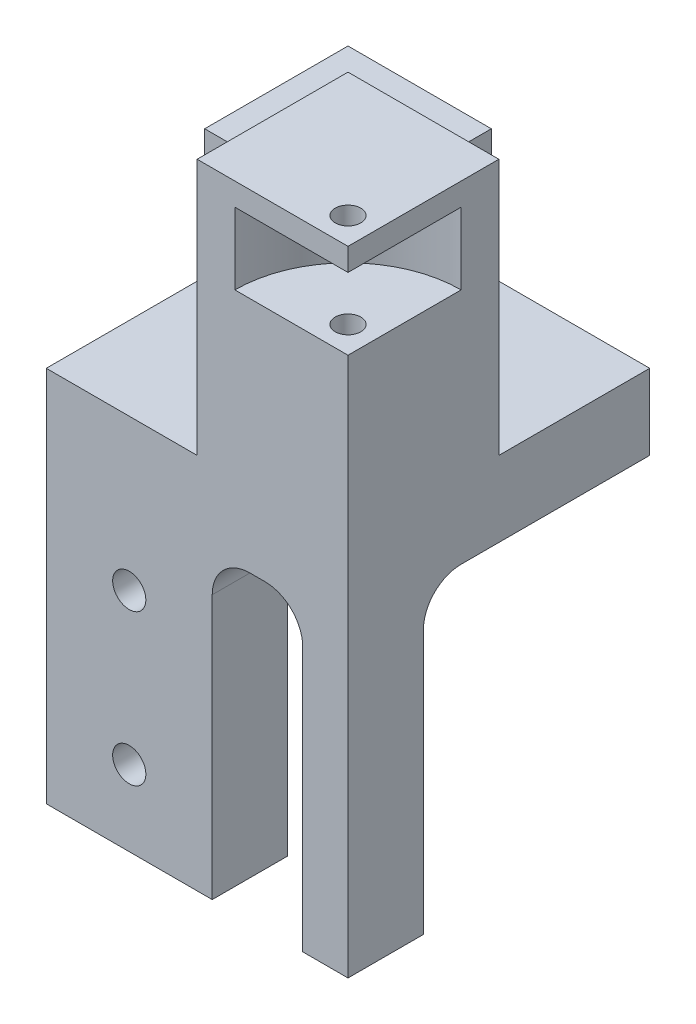
ISO-10303-21;
HEADER;
FILE_DESCRIPTION(('STEP AP214'),'2;1');
FILE_NAME('part.step','',(''),(''),'','','');
FILE_SCHEMA(('AUTOMOTIVE_DESIGN { 1 0 10303 214 1 1 1 1 }'));
ENDSEC;
DATA;
#1=APPLICATION_CONTEXT('core data for automotive mechanical design processes');
#2=APPLICATION_PROTOCOL_DEFINITION('international standard','automotive_design',2000,#1);
#3=PRODUCT_CONTEXT('',#1,'mechanical');
#4=PRODUCT('Part','Part','',(#3));
#5=PRODUCT_RELATED_PRODUCT_CATEGORY('part','',(#4));
#6=PRODUCT_DEFINITION_FORMATION('','',#4);
#7=PRODUCT_DEFINITION_CONTEXT('part definition',#1,'design');
#8=PRODUCT_DEFINITION('design','',#6,#7);
#9=PRODUCT_DEFINITION_SHAPE('','',#8);
#10=(LENGTH_UNIT() NAMED_UNIT(*) SI_UNIT(.MILLI.,.METRE.));
#11=(NAMED_UNIT(*) PLANE_ANGLE_UNIT() SI_UNIT($,.RADIAN.));
#12=(NAMED_UNIT(*) SI_UNIT($,.STERADIAN.) SOLID_ANGLE_UNIT());
#13=UNCERTAINTY_MEASURE_WITH_UNIT(LENGTH_MEASURE(1.E-05),#10,'distance_accuracy_value','');
#14=(GEOMETRIC_REPRESENTATION_CONTEXT(3) GLOBAL_UNCERTAINTY_ASSIGNED_CONTEXT((#13)) GLOBAL_UNIT_ASSIGNED_CONTEXT((#10,
#11,#12)) REPRESENTATION_CONTEXT('',''));
#15=CARTESIAN_POINT('',(0.,0.,0.));
#16=DIRECTION('',(0.,0.,1.));
#17=DIRECTION('',(1.,0.,0.));
#18=AXIS2_PLACEMENT_3D('',#15,#16,#17);
#19=CARTESIAN_POINT('',(-6.36538506760728,-50.,10.));
#20=DIRECTION('',(0.,1.,0.));
#21=DIRECTION('',(-1.,0.,0.));
#22=AXIS2_PLACEMENT_3D('',#19,#20,#21);
#23=PLANE('',#22);
#24=CARTESIAN_POINT('',(30.0990810264598,-50.,6.46446609406742));
#25=DIRECTION('',(0.,-1.,0.));
#26=DIRECTION('',(1.,0.,0.));
#27=AXIS2_PLACEMENT_3D('',#24,#25,#26);
#28=CIRCLE('',#27,1.69999999999999);
#29=CARTESIAN_POINT('',(31.7990810264598,-50.,6.46446609406742));
#30=VERTEX_POINT('',#29);
#31=EDGE_CURVE('E326',#30,#30,#28,.T.);
#32=ORIENTED_EDGE('',*,*,#31,.F.);
#33=EDGE_LOOP('',(#32));
#34=FACE_BOUND('',#33,.T.);
#35=DIRECTION('',(1.,0.,0.));
#36=VECTOR('',#35,1.);
#37=CARTESIAN_POINT('',(-6.36538506760728,-50.,10.));
#38=LINE('',#37,#36);
#39=CARTESIAN_POINT('',(27.6346149323927,-50.,10.));
#40=VERTEX_POINT('',#39);
#41=CARTESIAN_POINT('',(33.6346149323927,-50.,10.));
#42=VERTEX_POINT('',#41);
#43=EDGE_CURVE('E241',#40,#42,#38,.T.);
#44=ORIENTED_EDGE('',*,*,#43,.F.);
#45=DIRECTION('',(0.,0.,1.));
#46=VECTOR('',#45,1.);
#47=CARTESIAN_POINT('',(27.6346149323927,-50.,-30.001));
#48=LINE('',#47,#46);
#49=CARTESIAN_POINT('',(27.6346149323927,-50.,0.));
#50=VERTEX_POINT('',#49);
#51=EDGE_CURVE('E233',#50,#40,#48,.T.);
#52=ORIENTED_EDGE('',*,*,#51,.F.);
#53=DIRECTION('',(1.,0.,0.));
#54=VECTOR('',#53,1.);
#55=CARTESIAN_POINT('',(-6.36538506760728,-50.,0.));
#56=LINE('',#55,#54);
#57=CARTESIAN_POINT('',(33.6346149323927,-50.,0.));
#58=VERTEX_POINT('',#57);
#59=EDGE_CURVE('E254',#50,#58,#56,.T.);
#60=ORIENTED_EDGE('',*,*,#59,.T.);
#61=DIRECTION('',(0.,0.,-1.));
#62=VECTOR('',#61,1.);
#63=CARTESIAN_POINT('',(33.6346149323927,-50.,10.));
#64=LINE('',#63,#62);
#65=EDGE_CURVE('E263',#42,#58,#64,.T.);
#66=ORIENTED_EDGE('',*,*,#65,.F.);
#67=EDGE_LOOP('',(#44,#52,#60,#66));
#68=FACE_BOUND('',#67,.T.);
#69=ADVANCED_FACE('F43',(#34,#68),#23,.F.);
#70=CARTESIAN_POINT('',(0.,0.,0.));
#71=DIRECTION('',(0.,0.,1.));
#72=DIRECTION('',(1.,0.,0.));
#73=AXIS2_PLACEMENT_3D('',#70,#71,#72);
#74=PLANE('',#73);
#75=DIRECTION('',(0.,-1.,0.));
#76=VECTOR('',#75,1.);
#77=CARTESIAN_POINT('',(27.6346149323927,-50.,0.));
#78=LINE('',#77,#76);
#79=CARTESIAN_POINT('',(27.6346149323927,-15.,0.));
#80=VERTEX_POINT('',#79);
#81=EDGE_CURVE('E298',#80,#50,#78,.T.);
#82=ORIENTED_EDGE('',*,*,#81,.F.);
#83=DIRECTION('',(1.,0.,0.));
#84=VECTOR('',#83,1.);
#85=CARTESIAN_POINT('',(0.,-15.,0.));
#86=LINE('',#85,#84);
#87=CARTESIAN_POINT('',(33.6346149323927,-15.,0.));
#88=VERTEX_POINT('',#87);
#89=EDGE_CURVE('E60',#80,#88,#86,.T.);
#90=ORIENTED_EDGE('',*,*,#89,.T.);
#91=DIRECTION('',(0.,1.,0.));
#92=VECTOR('',#91,1.);
#93=CARTESIAN_POINT('',(33.6346149323927,0.,0.));
#94=LINE('',#93,#92);
#95=EDGE_CURVE('E257',#58,#88,#94,.T.);
#96=ORIENTED_EDGE('',*,*,#95,.F.);
#97=ORIENTED_EDGE('',*,*,#59,.F.);
#98=EDGE_LOOP('',(#82,#90,#96,#97));
#99=FACE_BOUND('',#98,.T.);
#100=ADVANCED_FACE('F485',(#99),#74,.F.);
#101=CARTESIAN_POINT('',(-6.36538506760727,0.,10.));
#102=DIRECTION('',(0.,-1.,0.));
#103=DIRECTION('',(1.,0.,0.));
#104=AXIS2_PLACEMENT_3D('',#101,#102,#103);
#105=PLANE('',#104);
#106=DIRECTION('',(1.,0.,0.));
#107=VECTOR('',#106,1.);
#108=CARTESIAN_POINT('',(-6.36538506760727,0.,-11.));
#109=LINE('',#108,#107);
#110=CARTESIAN_POINT('',(-6.36538506760727,0.,-11.));
#111=VERTEX_POINT('',#110);
#112=CARTESIAN_POINT('',(12.6346149323927,0.,-11.));
#113=VERTEX_POINT('',#112);
#114=EDGE_CURVE('E376',#111,#113,#109,.T.);
#115=ORIENTED_EDGE('',*,*,#114,.F.);
#116=DIRECTION('',(0.,0.,-1.));
#117=VECTOR('',#116,1.);
#118=CARTESIAN_POINT('',(-6.36538506760727,0.,10.));
#119=LINE('',#118,#117);
#120=CARTESIAN_POINT('',(-6.36538506760727,0.,10.));
#121=VERTEX_POINT('',#120);
#122=EDGE_CURVE('E251',#121,#111,#119,.T.);
#123=ORIENTED_EDGE('',*,*,#122,.F.);
#124=DIRECTION('',(-1.,0.,0.));
#125=VECTOR('',#124,1.);
#126=CARTESIAN_POINT('',(-6.36538506760727,0.,10.));
#127=LINE('',#126,#125);
#128=CARTESIAN_POINT('',(13.6346149323927,0.,10.));
#129=VERTEX_POINT('',#128);
#130=EDGE_CURVE('E249',#129,#121,#127,.T.);
#131=ORIENTED_EDGE('',*,*,#130,.F.);
#132=DIRECTION('',(0.,0.,1.));
#133=VECTOR('',#132,1.);
#134=CARTESIAN_POINT('',(13.6346149323927,0.,10.));
#135=LINE('',#134,#133);
#136=CARTESIAN_POINT('',(13.6346149323927,0.,-10.));
#137=VERTEX_POINT('',#136);
#138=EDGE_CURVE('E409',#137,#129,#135,.T.);
#139=ORIENTED_EDGE('',*,*,#138,.F.);
#140=DIRECTION('',(-1.,0.,0.));
#141=VECTOR('',#140,1.);
#142=CARTESIAN_POINT('',(33.6346149323927,0.,-10.));
#143=LINE('',#142,#141);
#144=CARTESIAN_POINT('',(33.6346149323927,0.,-10.));
#145=VERTEX_POINT('',#144);
#146=EDGE_CURVE('E404',#145,#137,#143,.T.);
#147=ORIENTED_EDGE('',*,*,#146,.F.);
#148=DIRECTION('',(0.,0.,-1.));
#149=VECTOR('',#148,1.);
#150=CARTESIAN_POINT('',(33.6346149323927,0.,10.));
#151=LINE('',#150,#149);
#152=CARTESIAN_POINT('',(33.6346149323927,0.,-30.));
#153=VERTEX_POINT('',#152);
#154=EDGE_CURVE('E261',#145,#153,#151,.T.);
#155=ORIENTED_EDGE('',*,*,#154,.T.);
#156=DIRECTION('',(-1.,0.,0.));
#157=VECTOR('',#156,1.);
#158=CARTESIAN_POINT('',(33.6346149323927,0.,-30.));
#159=LINE('',#158,#157);
#160=CARTESIAN_POINT('',(12.6346149323927,0.,-30.));
#161=VERTEX_POINT('',#160);
#162=EDGE_CURVE('E432',#153,#161,#159,.T.);
#163=ORIENTED_EDGE('',*,*,#162,.T.);
#164=DIRECTION('',(0.,0.,-1.));
#165=VECTOR('',#164,1.);
#166=CARTESIAN_POINT('',(12.6346149323927,0.,-30.));
#167=LINE('',#166,#165);
#168=EDGE_CURVE('E383',#113,#161,#167,.T.);
#169=ORIENTED_EDGE('',*,*,#168,.F.);
#170=EDGE_LOOP('',(#115,#123,#131,#139,#147,#155,#163,#169));
#171=FACE_BOUND('',#170,.T.);
#172=ADVANCED_FACE('F491',(#171),#105,.F.);
#173=CARTESIAN_POINT('',(-6.36538506760727,0.,10.));
#174=DIRECTION('',(1.,0.,0.));
#175=DIRECTION('',(0.,1.,0.));
#176=AXIS2_PLACEMENT_3D('',#173,#174,#175);
#177=PLANE('',#176);
#178=ORIENTED_EDGE('',*,*,#122,.T.);
#179=DIRECTION('',(0.,-1.,0.));
#180=VECTOR('',#179,1.);
#181=CARTESIAN_POINT('',(-6.36538506760727,17.,-11.));
#182=LINE('',#181,#180);
#183=CARTESIAN_POINT('',(-6.36538506760727,17.,-11.));
#184=VERTEX_POINT('',#183);
#185=EDGE_CURVE('E401',#184,#111,#182,.T.);
#186=ORIENTED_EDGE('',*,*,#185,.F.);
#187=DIRECTION('',(0.,0.,1.));
#188=VECTOR('',#187,1.);
#189=CARTESIAN_POINT('',(-6.36538506760727,17.,-30.));
#190=LINE('',#189,#188);
#191=CARTESIAN_POINT('',(-6.36538506760727,17.,-30.));
#192=VERTEX_POINT('',#191);
#193=EDGE_CURVE('E379',#192,#184,#190,.T.);
#194=ORIENTED_EDGE('',*,*,#193,.F.);
#195=DIRECTION('',(0.,-1.,0.));
#196=VECTOR('',#195,1.);
#197=CARTESIAN_POINT('',(-6.36538506760727,0.,-30.));
#198=LINE('',#197,#196);
#199=CARTESIAN_POINT('',(-6.36538506760727,-10.,-30.));
#200=VERTEX_POINT('',#199);
#201=EDGE_CURVE('E434',#192,#200,#198,.T.);
#202=ORIENTED_EDGE('',*,*,#201,.T.);
#203=DIRECTION('',(0.,0.,1.));
#204=VECTOR('',#203,1.);
#205=CARTESIAN_POINT('',(-6.36538506760727,-10.,-30.));
#206=LINE('',#205,#204);
#207=CARTESIAN_POINT('',(-6.36538506760727,-10.,-5.));
#208=VERTEX_POINT('',#207);
#209=EDGE_CURVE('E440',#200,#208,#206,.T.);
#210=ORIENTED_EDGE('',*,*,#209,.T.);
#211=CARTESIAN_POINT('',(-6.36538506760727,-15.,-5.));
#212=DIRECTION('',(1.,0.,0.));
#213=DIRECTION('',(0.,1.,0.));
#214=AXIS2_PLACEMENT_3D('',#211,#212,#213);
#215=CIRCLE('',#214,5.);
#216=CARTESIAN_POINT('',(-6.36538506760727,-15.,0.));
#217=VERTEX_POINT('',#216);
#218=EDGE_CURVE('E52',#208,#217,#215,.T.);
#219=ORIENTED_EDGE('',*,*,#218,.T.);
#220=DIRECTION('',(0.,-1.,0.));
#221=VECTOR('',#220,1.);
#222=CARTESIAN_POINT('',(-6.36538506760727,0.,0.));
#223=LINE('',#222,#221);
#224=CARTESIAN_POINT('',(-6.36538506760728,-50.,0.));
#225=VERTEX_POINT('',#224);
#226=EDGE_CURVE('E252',#217,#225,#223,.T.);
#227=ORIENTED_EDGE('',*,*,#226,.T.);
#228=DIRECTION('',(0.,0.,-1.));
#229=VECTOR('',#228,1.);
#230=CARTESIAN_POINT('',(-6.36538506760728,-50.,10.));
#231=LINE('',#230,#229);
#232=CARTESIAN_POINT('',(-6.36538506760728,-50.,10.));
#233=VERTEX_POINT('',#232);
#234=EDGE_CURVE('E266',#233,#225,#231,.T.);
#235=ORIENTED_EDGE('',*,*,#234,.F.);
#236=DIRECTION('',(0.,-1.,0.));
#237=VECTOR('',#236,1.);
#238=CARTESIAN_POINT('',(-6.36538506760727,0.,10.));
#239=LINE('',#238,#237);
#240=EDGE_CURVE('E238',#121,#233,#239,.T.);
#241=ORIENTED_EDGE('',*,*,#240,.F.);
#242=EDGE_LOOP('',(#178,#186,#194,#202,#210,#219,#227,#235,#241));
#243=FACE_BOUND('',#242,.T.);
#244=ADVANCED_FACE('F442',(#243),#177,.F.);
#245=CARTESIAN_POINT('',(15.6346149323927,-50.,0.));
#246=VERTEX_POINT('',#245);
#247=EDGE_CURVE('E232',#225,#246,#56,.T.);
#248=ORIENTED_EDGE('',*,*,#247,.T.);
#249=DIRECTION('',(0.,0.,1.));
#250=VECTOR('',#249,1.);
#251=CARTESIAN_POINT('',(15.6346149323927,-50.,-30.001));
#252=LINE('',#251,#250);
#253=CARTESIAN_POINT('',(15.6346149323927,-50.,10.));
#254=VERTEX_POINT('',#253);
#255=EDGE_CURVE('E217',#246,#254,#252,.T.);
#256=ORIENTED_EDGE('',*,*,#255,.T.);
#257=EDGE_CURVE('E229',#233,#254,#38,.T.);
#258=ORIENTED_EDGE('',*,*,#257,.F.);
#259=ORIENTED_EDGE('',*,*,#234,.T.);
#260=EDGE_LOOP('',(#248,#256,#258,#259));
#261=FACE_BOUND('',#260,.T.);
#262=ADVANCED_FACE('F227',(#261),#23,.F.);
#263=CARTESIAN_POINT('',(33.6346149323927,0.,10.));
#264=DIRECTION('',(-1.,0.,0.));
#265=DIRECTION('',(0.,0.,1.));
#266=AXIS2_PLACEMENT_3D('',#263,#264,#265);
#267=PLANE('',#266);
#268=DIRECTION('',(0.,1.,0.));
#269=VECTOR('',#268,1.);
#270=CARTESIAN_POINT('',(33.6346149323927,21.5,-5.));
#271=LINE('',#270,#269);
#272=CARTESIAN_POINT('',(33.6346149323927,21.5,-5.));
#273=VERTEX_POINT('',#272);
#274=CARTESIAN_POINT('',(33.6346149323927,31.,-5.));
#275=VERTEX_POINT('',#274);
#276=EDGE_CURVE('E374',#273,#275,#271,.T.);
#277=ORIENTED_EDGE('',*,*,#276,.F.);
#278=DIRECTION('',(0.,0.,-1.));
#279=VECTOR('',#278,1.);
#280=CARTESIAN_POINT('',(33.6346149323927,21.5,-5.));
#281=LINE('',#280,#279);
#282=CARTESIAN_POINT('',(33.6346149323927,21.5,10.));
#283=VERTEX_POINT('',#282);
#284=EDGE_CURVE('E363',#283,#273,#281,.T.);
#285=ORIENTED_EDGE('',*,*,#284,.F.);
#286=DIRECTION('',(0.,1.,0.));
#287=VECTOR('',#286,1.);
#288=CARTESIAN_POINT('',(33.6346149323927,0.,10.));
#289=LINE('',#288,#287);
#290=EDGE_CURVE('E243',#42,#283,#289,.T.);
#291=ORIENTED_EDGE('',*,*,#290,.F.);
#292=ORIENTED_EDGE('',*,*,#65,.T.);
#293=ORIENTED_EDGE('',*,*,#95,.T.);
#294=CARTESIAN_POINT('',(33.6346149323927,-15.,-5.));
#295=DIRECTION('',(-1.,0.,0.));
#296=DIRECTION('',(0.,0.,1.));
#297=AXIS2_PLACEMENT_3D('',#294,#295,#296);
#298=CIRCLE('',#297,5.);
#299=CARTESIAN_POINT('',(33.6346149323927,-10.,-5.));
#300=VERTEX_POINT('',#299);
#301=EDGE_CURVE('E11',#88,#300,#298,.T.);
#302=ORIENTED_EDGE('',*,*,#301,.T.);
#303=DIRECTION('',(0.,0.,1.));
#304=VECTOR('',#303,1.);
#305=CARTESIAN_POINT('',(33.6346149323927,-10.,-30.));
#306=LINE('',#305,#304);
#307=CARTESIAN_POINT('',(33.6346149323927,-10.,-30.));
#308=VERTEX_POINT('',#307);
#309=EDGE_CURVE('E255',#308,#300,#306,.T.);
#310=ORIENTED_EDGE('',*,*,#309,.F.);
#311=DIRECTION('',(0.,1.,0.));
#312=VECTOR('',#311,1.);
#313=CARTESIAN_POINT('',(33.6346149323927,0.,-30.));
#314=LINE('',#313,#312);
#315=EDGE_CURVE('E429',#308,#153,#314,.T.);
#316=ORIENTED_EDGE('',*,*,#315,.T.);
#317=ORIENTED_EDGE('',*,*,#154,.F.);
#318=DIRECTION('',(0.,-1.,0.));
#319=VECTOR('',#318,1.);
#320=CARTESIAN_POINT('',(33.6346149323927,34.,-10.));
#321=LINE('',#320,#319);
#322=CARTESIAN_POINT('',(33.6346149323927,34.,-10.));
#323=VERTEX_POINT('',#322);
#324=EDGE_CURVE('E426',#323,#145,#321,.T.);
#325=ORIENTED_EDGE('',*,*,#324,.F.);
#326=DIRECTION('',(0.,0.,-1.));
#327=VECTOR('',#326,1.);
#328=CARTESIAN_POINT('',(33.6346149323927,34.,10.));
#329=LINE('',#328,#327);
#330=CARTESIAN_POINT('',(33.6346149323927,34.,10.));
#331=VERTEX_POINT('',#330);
#332=EDGE_CURVE('E405',#331,#323,#329,.T.);
#333=ORIENTED_EDGE('',*,*,#332,.F.);
#334=CARTESIAN_POINT('',(33.6346149323927,31.,10.));
#335=VERTEX_POINT('',#334);
#336=EDGE_CURVE('E240',#335,#331,#289,.T.);
#337=ORIENTED_EDGE('',*,*,#336,.F.);
#338=DIRECTION('',(0.,0.,-1.));
#339=VECTOR('',#338,1.);
#340=CARTESIAN_POINT('',(33.6346149323927,31.,-5.));
#341=LINE('',#340,#339);
#342=EDGE_CURVE('E361',#335,#275,#341,.T.);
#343=ORIENTED_EDGE('',*,*,#342,.T.);
#344=EDGE_LOOP('',(#277,#285,#291,#292,#293,#302,#310,#316,#317,#325,#333,#337,#343));
#345=FACE_BOUND('',#344,.T.);
#346=ADVANCED_FACE('F497',(#345),#267,.F.);
#347=CARTESIAN_POINT('',(0.,0.,10.));
#348=DIRECTION('',(0.,0.,1.));
#349=DIRECTION('',(1.,0.,0.));
#350=AXIS2_PLACEMENT_3D('',#347,#348,#349);
#351=PLANE('',#350);
#352=CARTESIAN_POINT('',(4.63461493239273,-20.,10.));
#353=DIRECTION('',(0.,0.,1.));
#354=DIRECTION('',(1.,0.,0.));
#355=AXIS2_PLACEMENT_3D('',#352,#353,#354);
#356=CIRCLE('',#355,2.2);
#357=CARTESIAN_POINT('',(6.83461493239273,-20.,10.));
#358=VERTEX_POINT('',#357);
#359=EDGE_CURVE('E307',#358,#358,#356,.T.);
#360=ORIENTED_EDGE('',*,*,#359,.F.);
#361=EDGE_LOOP('',(#360));
#362=FACE_BOUND('',#361,.T.);
#363=CARTESIAN_POINT('',(4.63461493239273,-40.,10.));
#364=DIRECTION('',(0.,0.,1.));
#365=DIRECTION('',(1.,0.,0.));
#366=AXIS2_PLACEMENT_3D('',#363,#364,#365);
#367=CIRCLE('',#366,2.2);
#368=CARTESIAN_POINT('',(6.83461493239273,-40.,10.));
#369=VERTEX_POINT('',#368);
#370=EDGE_CURVE('E312',#369,#369,#367,.T.);
#371=ORIENTED_EDGE('',*,*,#370,.F.);
#372=EDGE_LOOP('',(#371));
#373=FACE_BOUND('',#372,.T.);
#374=DIRECTION('',(0.,1.,0.));
#375=VECTOR('',#374,1.);
#376=CARTESIAN_POINT('',(27.6346149323927,-50.,10.));
#377=LINE('',#376,#375);
#378=CARTESIAN_POINT('',(27.6346149323927,-15.,10.));
#379=VERTEX_POINT('',#378);
#380=EDGE_CURVE('E321',#40,#379,#377,.T.);
#381=ORIENTED_EDGE('',*,*,#380,.F.);
#382=ORIENTED_EDGE('',*,*,#43,.T.);
#383=ORIENTED_EDGE('',*,*,#290,.T.);
#384=DIRECTION('',(1.,0.,0.));
#385=VECTOR('',#384,1.);
#386=CARTESIAN_POINT('',(33.6346149323927,21.5,10.));
#387=LINE('',#386,#385);
#388=CARTESIAN_POINT('',(18.6346149323927,21.5,10.));
#389=VERTEX_POINT('',#388);
#390=EDGE_CURVE('E360',#389,#283,#387,.T.);
#391=ORIENTED_EDGE('',*,*,#390,.F.);
#392=DIRECTION('',(0.,1.,0.));
#393=VECTOR('',#392,1.);
#394=CARTESIAN_POINT('',(18.6346149323927,21.5,10.));
#395=LINE('',#394,#393);
#396=CARTESIAN_POINT('',(18.6346149323927,31.,10.));
#397=VERTEX_POINT('',#396);
#398=EDGE_CURVE('E366',#389,#397,#395,.T.);
#399=ORIENTED_EDGE('',*,*,#398,.T.);
#400=DIRECTION('',(1.,0.,0.));
#401=VECTOR('',#400,1.);
#402=CARTESIAN_POINT('',(33.6346149323927,31.,10.));
#403=LINE('',#402,#401);
#404=EDGE_CURVE('E369',#397,#335,#403,.T.);
#405=ORIENTED_EDGE('',*,*,#404,.T.);
#406=ORIENTED_EDGE('',*,*,#336,.T.);
#407=DIRECTION('',(1.,0.,0.));
#408=VECTOR('',#407,1.);
#409=CARTESIAN_POINT('',(33.6346149323927,34.,10.));
#410=LINE('',#409,#408);
#411=CARTESIAN_POINT('',(13.6346149323927,34.,10.));
#412=VERTEX_POINT('',#411);
#413=EDGE_CURVE('E413',#412,#331,#410,.T.);
#414=ORIENTED_EDGE('',*,*,#413,.F.);
#415=DIRECTION('',(0.,-1.,0.));
#416=VECTOR('',#415,1.);
#417=CARTESIAN_POINT('',(13.6346149323927,34.,10.));
#418=LINE('',#417,#416);
#419=EDGE_CURVE('E416',#412,#129,#418,.T.);
#420=ORIENTED_EDGE('',*,*,#419,.T.);
#421=ORIENTED_EDGE('',*,*,#130,.T.);
#422=ORIENTED_EDGE('',*,*,#240,.T.);
#423=ORIENTED_EDGE('',*,*,#257,.T.);
#424=DIRECTION('',(0.,-1.,0.));
#425=VECTOR('',#424,1.);
#426=CARTESIAN_POINT('',(15.6346149323927,-50.,10.));
#427=LINE('',#426,#425);
#428=CARTESIAN_POINT('',(15.6346149323927,-15.,10.));
#429=VERTEX_POINT('',#428);
#430=EDGE_CURVE('E213',#429,#254,#427,.T.);
#431=ORIENTED_EDGE('',*,*,#430,.F.);
#432=CARTESIAN_POINT('',(20.6346149323927,-15.,10.));
#433=DIRECTION('',(0.,0.,1.));
#434=DIRECTION('',(1.,0.,0.));
#435=AXIS2_PLACEMENT_3D('',#432,#433,#434);
#436=CIRCLE('',#435,5.);
#437=CARTESIAN_POINT('',(20.6346149323927,-10.,10.));
#438=VERTEX_POINT('',#437);
#439=EDGE_CURVE('E288',#429,#438,#436,.F.);
#440=ORIENTED_EDGE('',*,*,#439,.T.);
#441=DIRECTION('',(-1.,0.,0.));
#442=VECTOR('',#441,1.);
#443=CARTESIAN_POINT('',(27.6346149323927,-10.,10.));
#444=LINE('',#443,#442);
#445=CARTESIAN_POINT('',(22.6346149323927,-10.,10.));
#446=VERTEX_POINT('',#445);
#447=EDGE_CURVE('E223',#446,#438,#444,.T.);
#448=ORIENTED_EDGE('',*,*,#447,.F.);
#449=CARTESIAN_POINT('',(22.6346149323927,-15.,10.));
#450=DIRECTION('',(0.,0.,1.));
#451=DIRECTION('',(1.,0.,0.));
#452=AXIS2_PLACEMENT_3D('',#449,#450,#451);
#453=CIRCLE('',#452,5.);
#454=EDGE_CURVE('E290',#446,#379,#453,.F.);
#455=ORIENTED_EDGE('',*,*,#454,.T.);
#456=EDGE_LOOP('',(#381,#382,#383,#391,#399,#405,#406,#414,#420,#421,#422,#423,#431,#440,#448,#455));
#457=FACE_BOUND('',#456,.T.);
#458=ADVANCED_FACE('F236',(#362,#373,#457),#351,.T.);
#459=CARTESIAN_POINT('',(4.63461493239273,-20.,0.));
#460=DIRECTION('',(0.,0.,1.));
#461=DIRECTION('',(1.,0.,0.));
#462=AXIS2_PLACEMENT_3D('',#459,#460,#461);
#463=CIRCLE('',#462,2.2);
#464=CARTESIAN_POINT('',(6.83461493239273,-20.,0.));
#465=VERTEX_POINT('',#464);
#466=EDGE_CURVE('E301',#465,#465,#463,.F.);
#467=ORIENTED_EDGE('',*,*,#466,.F.);
#468=EDGE_LOOP('',(#467));
#469=FACE_BOUND('',#468,.T.);
#470=CARTESIAN_POINT('',(4.63461493239273,-40.,0.));
#471=DIRECTION('',(0.,0.,1.));
#472=DIRECTION('',(1.,0.,0.));
#473=AXIS2_PLACEMENT_3D('',#470,#471,#472);
#474=CIRCLE('',#473,2.2);
#475=CARTESIAN_POINT('',(6.83461493239273,-40.,0.));
#476=VERTEX_POINT('',#475);
#477=EDGE_CURVE('E315',#476,#476,#474,.F.);
#478=ORIENTED_EDGE('',*,*,#477,.F.);
#479=EDGE_LOOP('',(#478));
#480=FACE_BOUND('',#479,.T.);
#481=ORIENTED_EDGE('',*,*,#226,.F.);
#482=DIRECTION('',(1.,0.,0.));
#483=VECTOR('',#482,1.);
#484=CARTESIAN_POINT('',(0.,-15.,0.));
#485=LINE('',#484,#483);
#486=CARTESIAN_POINT('',(15.6346149323927,-15.,0.));
#487=VERTEX_POINT('',#486);
#488=EDGE_CURVE('E285',#217,#487,#485,.T.);
#489=ORIENTED_EDGE('',*,*,#488,.T.);
#490=DIRECTION('',(0.,1.,0.));
#491=VECTOR('',#490,1.);
#492=CARTESIAN_POINT('',(15.6346149323927,-50.,0.));
#493=LINE('',#492,#491);
#494=EDGE_CURVE('E294',#246,#487,#493,.T.);
#495=ORIENTED_EDGE('',*,*,#494,.F.);
#496=ORIENTED_EDGE('',*,*,#247,.F.);
#497=EDGE_LOOP('',(#481,#489,#495,#496));
#498=FACE_BOUND('',#497,.T.);
#499=ADVANCED_FACE('F451',(#469,#480,#498),#74,.F.);
#500=CARTESIAN_POINT('',(33.6346149323927,-10.,-30.));
#501=DIRECTION('',(0.,-1.,0.));
#502=DIRECTION('',(0.,0.,-1.));
#503=AXIS2_PLACEMENT_3D('',#500,#501,#502);
#504=PLANE('',#503);
#505=ORIENTED_EDGE('',*,*,#447,.T.);
#506=DIRECTION('',(0.,0.,1.));
#507=VECTOR('',#506,1.);
#508=CARTESIAN_POINT('',(20.6346149323927,-10.,-30.));
#509=LINE('',#508,#507);
#510=CARTESIAN_POINT('',(20.6346149323927,-10.,-5.));
#511=VERTEX_POINT('',#510);
#512=EDGE_CURVE('E281',#438,#511,#509,.F.);
#513=ORIENTED_EDGE('',*,*,#512,.T.);
#514=DIRECTION('',(1.,0.,0.));
#515=VECTOR('',#514,1.);
#516=CARTESIAN_POINT('',(33.6346149323927,-10.,-5.));
#517=LINE('',#516,#515);
#518=EDGE_CURVE('E279',#511,#208,#517,.F.);
#519=ORIENTED_EDGE('',*,*,#518,.T.);
#520=ORIENTED_EDGE('',*,*,#209,.F.);
#521=DIRECTION('',(1.,0.,0.));
#522=VECTOR('',#521,1.);
#523=CARTESIAN_POINT('',(33.6346149323927,-10.,-30.));
#524=LINE('',#523,#522);
#525=EDGE_CURVE('E437',#200,#308,#524,.T.);
#526=ORIENTED_EDGE('',*,*,#525,.T.);
#527=ORIENTED_EDGE('',*,*,#309,.T.);
#528=DIRECTION('',(1.,0.,0.));
#529=VECTOR('',#528,1.);
#530=CARTESIAN_POINT('',(33.6346149323927,-10.,-5.));
#531=LINE('',#530,#529);
#532=CARTESIAN_POINT('',(22.6346149323927,-10.,-5.));
#533=VERTEX_POINT('',#532);
#534=EDGE_CURVE('E274',#300,#533,#531,.F.);
#535=ORIENTED_EDGE('',*,*,#534,.T.);
#536=DIRECTION('',(0.,0.,1.));
#537=VECTOR('',#536,1.);
#538=CARTESIAN_POINT('',(22.6346149323927,-10.,-30.));
#539=LINE('',#538,#537);
#540=EDGE_CURVE('E276',#533,#446,#539,.T.);
#541=ORIENTED_EDGE('',*,*,#540,.T.);
#542=EDGE_LOOP('',(#505,#513,#519,#520,#526,#527,#535,#541));
#543=FACE_BOUND('',#542,.T.);
#544=ADVANCED_FACE('F468',(#543),#504,.T.);
#545=CARTESIAN_POINT('',(0.,0.,-30.));
#546=DIRECTION('',(0.,0.,-1.));
#547=DIRECTION('',(-1.,0.,0.));
#548=AXIS2_PLACEMENT_3D('',#545,#546,#547);
#549=PLANE('',#548);
#550=ORIENTED_EDGE('',*,*,#315,.F.);
#551=ORIENTED_EDGE('',*,*,#525,.F.);
#552=ORIENTED_EDGE('',*,*,#201,.F.);
#553=DIRECTION('',(-1.,0.,0.));
#554=VECTOR('',#553,1.);
#555=CARTESIAN_POINT('',(-6.36538506760727,17.,-30.));
#556=LINE('',#555,#554);
#557=CARTESIAN_POINT('',(12.6346149323927,17.,-30.));
#558=VERTEX_POINT('',#557);
#559=EDGE_CURVE('E387',#558,#192,#556,.T.);
#560=ORIENTED_EDGE('',*,*,#559,.F.);
#561=DIRECTION('',(0.,-1.,0.));
#562=VECTOR('',#561,1.);
#563=CARTESIAN_POINT('',(12.6346149323927,17.,-30.));
#564=LINE('',#563,#562);
#565=EDGE_CURVE('E390',#558,#161,#564,.T.);
#566=ORIENTED_EDGE('',*,*,#565,.T.);
#567=ORIENTED_EDGE('',*,*,#162,.F.);
#568=EDGE_LOOP('',(#550,#551,#552,#560,#566,#567));
#569=FACE_BOUND('',#568,.T.);
#570=ADVANCED_FACE('F466',(#569),#549,.T.);
#571=CARTESIAN_POINT('',(33.6346149323927,34.,-10.));
#572=DIRECTION('',(0.,0.,1.));
#573=DIRECTION('',(1.,0.,0.));
#574=AXIS2_PLACEMENT_3D('',#571,#572,#573);
#575=PLANE('',#574);
#576=ORIENTED_EDGE('',*,*,#146,.T.);
#577=DIRECTION('',(0.,-1.,0.));
#578=VECTOR('',#577,1.);
#579=CARTESIAN_POINT('',(13.6346149323927,34.,-10.));
#580=LINE('',#579,#578);
#581=CARTESIAN_POINT('',(13.6346149323927,34.,-10.));
#582=VERTEX_POINT('',#581);
#583=EDGE_CURVE('E423',#582,#137,#580,.T.);
#584=ORIENTED_EDGE('',*,*,#583,.F.);
#585=DIRECTION('',(-1.,0.,0.));
#586=VECTOR('',#585,1.);
#587=CARTESIAN_POINT('',(33.6346149323927,34.,-10.));
#588=LINE('',#587,#586);
#589=EDGE_CURVE('E408',#323,#582,#588,.T.);
#590=ORIENTED_EDGE('',*,*,#589,.F.);
#591=ORIENTED_EDGE('',*,*,#324,.T.);
#592=EDGE_LOOP('',(#576,#584,#590,#591));
#593=FACE_BOUND('',#592,.T.);
#594=ADVANCED_FACE('F518',(#593),#575,.F.);
#595=CARTESIAN_POINT('',(13.6346149323927,34.,10.));
#596=DIRECTION('',(1.,0.,0.));
#597=DIRECTION('',(0.,1.,0.));
#598=AXIS2_PLACEMENT_3D('',#595,#596,#597);
#599=PLANE('',#598);
#600=ORIENTED_EDGE('',*,*,#138,.T.);
#601=ORIENTED_EDGE('',*,*,#419,.F.);
#602=DIRECTION('',(0.,0.,1.));
#603=VECTOR('',#602,1.);
#604=CARTESIAN_POINT('',(13.6346149323927,34.,10.));
#605=LINE('',#604,#603);
#606=EDGE_CURVE('E411',#582,#412,#605,.T.);
#607=ORIENTED_EDGE('',*,*,#606,.F.);
#608=ORIENTED_EDGE('',*,*,#583,.T.);
#609=EDGE_LOOP('',(#600,#601,#607,#608));
#610=FACE_BOUND('',#609,.T.);
#611=ADVANCED_FACE('F521',(#610),#599,.F.);
#612=CARTESIAN_POINT('',(0.,34.,0.));
#613=DIRECTION('',(0.,1.,0.));
#614=DIRECTION('',(-1.,0.,0.));
#615=AXIS2_PLACEMENT_3D('',#612,#613,#614);
#616=PLANE('',#615);
#617=CARTESIAN_POINT('',(30.0990810264598,34.,6.46446609406742));
#618=DIRECTION('',(0.,-1.,0.));
#619=DIRECTION('',(1.,0.,0.));
#620=AXIS2_PLACEMENT_3D('',#617,#618,#619);
#621=CIRCLE('',#620,1.69999999999999);
#622=CARTESIAN_POINT('',(31.7990810264598,34.,6.46446609406742));
#623=VERTEX_POINT('',#622);
#624=EDGE_CURVE('E272',#623,#623,#621,.T.);
#625=ORIENTED_EDGE('',*,*,#624,.T.);
#626=EDGE_LOOP('',(#625));
#627=FACE_BOUND('',#626,.T.);
#628=ORIENTED_EDGE('',*,*,#332,.T.);
#629=ORIENTED_EDGE('',*,*,#589,.T.);
#630=ORIENTED_EDGE('',*,*,#606,.T.);
#631=ORIENTED_EDGE('',*,*,#413,.T.);
#632=EDGE_LOOP('',(#628,#629,#630,#631));
#633=FACE_BOUND('',#632,.T.);
#634=ADVANCED_FACE('F525',(#627,#633),#616,.T.);
#635=CARTESIAN_POINT('',(-6.36538506760727,17.,-11.));
#636=DIRECTION('',(0.,0.,-1.));
#637=DIRECTION('',(-1.,0.,0.));
#638=AXIS2_PLACEMENT_3D('',#635,#636,#637);
#639=PLANE('',#638);
#640=DIRECTION('',(0.,-1.,0.));
#641=VECTOR('',#640,1.);
#642=CARTESIAN_POINT('',(12.6346149323927,17.,-11.));
#643=LINE('',#642,#641);
#644=CARTESIAN_POINT('',(12.6346149323927,5.5,-11.));
#645=VERTEX_POINT('',#644);
#646=EDGE_CURVE('E397',#645,#113,#643,.T.);
#647=ORIENTED_EDGE('',*,*,#646,.F.);
#648=DIRECTION('',(1.,0.,0.));
#649=VECTOR('',#648,1.);
#650=CARTESIAN_POINT('',(-2.36538506760727,5.5,-11.));
#651=LINE('',#650,#649);
#652=CARTESIAN_POINT('',(-2.36538506760727,5.5,-11.));
#653=VERTEX_POINT('',#652);
#654=EDGE_CURVE('E342',#653,#645,#651,.T.);
#655=ORIENTED_EDGE('',*,*,#654,.F.);
#656=DIRECTION('',(0.,1.,0.));
#657=VECTOR('',#656,1.);
#658=CARTESIAN_POINT('',(-2.36538506760727,5.5,-11.));
#659=LINE('',#658,#657);
#660=CARTESIAN_POINT('',(-2.36538506760727,15.,-11.));
#661=VERTEX_POINT('',#660);
#662=EDGE_CURVE('E351',#653,#661,#659,.T.);
#663=ORIENTED_EDGE('',*,*,#662,.T.);
#664=DIRECTION('',(1.,0.,0.));
#665=VECTOR('',#664,1.);
#666=CARTESIAN_POINT('',(-2.36538506760727,15.,-11.));
#667=LINE('',#666,#665);
#668=CARTESIAN_POINT('',(12.6346149323927,15.,-11.));
#669=VERTEX_POINT('',#668);
#670=EDGE_CURVE('E339',#661,#669,#667,.T.);
#671=ORIENTED_EDGE('',*,*,#670,.T.);
#672=CARTESIAN_POINT('',(12.6346149323927,17.,-11.));
#673=VERTEX_POINT('',#672);
#674=EDGE_CURVE('E398',#673,#669,#643,.T.);
#675=ORIENTED_EDGE('',*,*,#674,.F.);
#676=DIRECTION('',(1.,0.,0.));
#677=VECTOR('',#676,1.);
#678=CARTESIAN_POINT('',(-6.36538506760727,17.,-11.));
#679=LINE('',#678,#677);
#680=EDGE_CURVE('E382',#184,#673,#679,.T.);
#681=ORIENTED_EDGE('',*,*,#680,.F.);
#682=ORIENTED_EDGE('',*,*,#185,.T.);
#683=ORIENTED_EDGE('',*,*,#114,.T.);
#684=EDGE_LOOP('',(#647,#655,#663,#671,#675,#681,#682,#683));
#685=FACE_BOUND('',#684,.T.);
#686=ADVANCED_FACE('F457',(#685),#639,.F.);
#687=CARTESIAN_POINT('',(12.6346149323927,17.,-30.));
#688=DIRECTION('',(-1.,0.,0.));
#689=DIRECTION('',(0.,-1.,0.));
#690=AXIS2_PLACEMENT_3D('',#687,#688,#689);
#691=PLANE('',#690);
#692=DIRECTION('',(0.,1.,0.));
#693=VECTOR('',#692,1.);
#694=CARTESIAN_POINT('',(12.6346149323927,5.5,-26.));
#695=LINE('',#694,#693);
#696=CARTESIAN_POINT('',(12.6346149323927,5.5,-26.));
#697=VERTEX_POINT('',#696);
#698=CARTESIAN_POINT('',(12.6346149323927,15.,-26.));
#699=VERTEX_POINT('',#698);
#700=EDGE_CURVE('E344',#697,#699,#695,.T.);
#701=ORIENTED_EDGE('',*,*,#700,.F.);
#702=DIRECTION('',(0.,0.,-1.));
#703=VECTOR('',#702,1.);
#704=CARTESIAN_POINT('',(12.6346149323927,5.5,-11.));
#705=LINE('',#704,#703);
#706=EDGE_CURVE('E335',#645,#697,#705,.T.);
#707=ORIENTED_EDGE('',*,*,#706,.F.);
#708=ORIENTED_EDGE('',*,*,#646,.T.);
#709=ORIENTED_EDGE('',*,*,#168,.T.);
#710=ORIENTED_EDGE('',*,*,#565,.F.);
#711=DIRECTION('',(0.,0.,-1.));
#712=VECTOR('',#711,1.);
#713=CARTESIAN_POINT('',(12.6346149323927,17.,-30.));
#714=LINE('',#713,#712);
#715=EDGE_CURVE('E385',#673,#558,#714,.T.);
#716=ORIENTED_EDGE('',*,*,#715,.F.);
#717=ORIENTED_EDGE('',*,*,#674,.T.);
#718=DIRECTION('',(0.,0.,-1.));
#719=VECTOR('',#718,1.);
#720=CARTESIAN_POINT('',(12.6346149323927,15.,-11.));
#721=LINE('',#720,#719);
#722=EDGE_CURVE('E334',#669,#699,#721,.T.);
#723=ORIENTED_EDGE('',*,*,#722,.T.);
#724=EDGE_LOOP('',(#701,#707,#708,#709,#710,#716,#717,#723));
#725=FACE_BOUND('',#724,.T.);
#726=ADVANCED_FACE('F532',(#725),#691,.F.);
#727=CARTESIAN_POINT('',(0.,17.,0.));
#728=DIRECTION('',(0.,1.,0.));
#729=DIRECTION('',(-1.,0.,0.));
#730=AXIS2_PLACEMENT_3D('',#727,#728,#729);
#731=PLANE('',#730);
#732=ORIENTED_EDGE('',*,*,#193,.T.);
#733=ORIENTED_EDGE('',*,*,#680,.T.);
#734=ORIENTED_EDGE('',*,*,#715,.T.);
#735=ORIENTED_EDGE('',*,*,#559,.T.);
#736=EDGE_LOOP('',(#732,#733,#734,#735));
#737=FACE_BOUND('',#736,.T.);
#738=ADVANCED_FACE('F461',(#737),#731,.T.);
#739=CARTESIAN_POINT('',(33.6346149323927,21.5,10.));
#740=DIRECTION('',(0.,1.,0.));
#741=DIRECTION('',(-1.,0.,0.));
#742=AXIS2_PLACEMENT_3D('',#739,#740,#741);
#743=CYLINDRICAL_SURFACE('',#742,15.);
#744=CARTESIAN_POINT('',(33.6346149323927,31.,10.));
#745=DIRECTION('',(0.,1.,0.));
#746=DIRECTION('',(1.,0.,0.));
#747=AXIS2_PLACEMENT_3D('',#744,#745,#746);
#748=CIRCLE('',#747,15.);
#749=EDGE_CURVE('E354',#275,#397,#748,.T.);
#750=ORIENTED_EDGE('',*,*,#749,.T.);
#751=ORIENTED_EDGE('',*,*,#398,.F.);
#752=CARTESIAN_POINT('',(33.6346149323927,21.5,10.));
#753=DIRECTION('',(0.,1.,0.));
#754=DIRECTION('',(1.,0.,0.));
#755=AXIS2_PLACEMENT_3D('',#752,#753,#754);
#756=CIRCLE('',#755,15.);
#757=EDGE_CURVE('E357',#273,#389,#756,.T.);
#758=ORIENTED_EDGE('',*,*,#757,.F.);
#759=ORIENTED_EDGE('',*,*,#276,.T.);
#760=EDGE_LOOP('',(#750,#751,#758,#759));
#761=FACE_BOUND('',#760,.T.);
#762=ADVANCED_FACE('F538',(#761),#743,.F.);
#763=CARTESIAN_POINT('',(33.6346149323927,21.5,10.));
#764=DIRECTION('',(0.,-1.,0.));
#765=DIRECTION('',(1.,0.,0.));
#766=AXIS2_PLACEMENT_3D('',#763,#764,#765);
#767=PLANE('',#766);
#768=CARTESIAN_POINT('',(30.0990810264598,21.5,6.46446609406742));
#769=DIRECTION('',(0.,-1.,0.));
#770=DIRECTION('',(1.,0.,0.));
#771=AXIS2_PLACEMENT_3D('',#768,#769,#770);
#772=CIRCLE('',#771,1.69999999999999);
#773=CARTESIAN_POINT('',(31.7990810264598,21.5,6.46446609406742));
#774=VERTEX_POINT('',#773);
#775=EDGE_CURVE('E271',#774,#774,#772,.T.);
#776=ORIENTED_EDGE('',*,*,#775,.T.);
#777=EDGE_LOOP('',(#776));
#778=FACE_BOUND('',#777,.T.);
#779=ORIENTED_EDGE('',*,*,#757,.T.);
#780=ORIENTED_EDGE('',*,*,#390,.T.);
#781=ORIENTED_EDGE('',*,*,#284,.T.);
#782=EDGE_LOOP('',(#779,#780,#781));
#783=FACE_BOUND('',#782,.T.);
#784=ADVANCED_FACE('F541',(#778,#783),#767,.F.);
#785=CARTESIAN_POINT('',(33.6346149323927,31.,10.));
#786=DIRECTION('',(0.,-1.,0.));
#787=DIRECTION('',(1.,0.,0.));
#788=AXIS2_PLACEMENT_3D('',#785,#786,#787);
#789=PLANE('',#788);
#790=CARTESIAN_POINT('',(30.0990810264598,31.,6.46446609406742));
#791=DIRECTION('',(0.,-1.,0.));
#792=DIRECTION('',(1.,0.,0.));
#793=AXIS2_PLACEMENT_3D('',#790,#791,#792);
#794=CIRCLE('',#793,1.69999999999999);
#795=CARTESIAN_POINT('',(31.7990810264598,31.,6.46446609406742));
#796=VERTEX_POINT('',#795);
#797=EDGE_CURVE('E268',#796,#796,#794,.T.);
#798=ORIENTED_EDGE('',*,*,#797,.F.);
#799=EDGE_LOOP('',(#798));
#800=FACE_BOUND('',#799,.T.);
#801=ORIENTED_EDGE('',*,*,#749,.F.);
#802=ORIENTED_EDGE('',*,*,#342,.F.);
#803=ORIENTED_EDGE('',*,*,#404,.F.);
#804=EDGE_LOOP('',(#801,#802,#803));
#805=FACE_BOUND('',#804,.T.);
#806=ADVANCED_FACE('F543',(#800,#805),#789,.T.);
#807=CARTESIAN_POINT('',(12.6346149323927,5.5,-11.));
#808=DIRECTION('',(0.,1.,0.));
#809=DIRECTION('',(-1.,0.,0.));
#810=AXIS2_PLACEMENT_3D('',#807,#808,#809);
#811=CYLINDRICAL_SURFACE('',#810,15.);
#812=CARTESIAN_POINT('',(12.6346149323927,15.,-11.));
#813=DIRECTION('',(0.,1.,0.));
#814=DIRECTION('',(1.,0.,0.));
#815=AXIS2_PLACEMENT_3D('',#812,#813,#814);
#816=CIRCLE('',#815,15.);
#817=EDGE_CURVE('E347',#699,#661,#816,.T.);
#818=ORIENTED_EDGE('',*,*,#817,.T.);
#819=ORIENTED_EDGE('',*,*,#662,.F.);
#820=CARTESIAN_POINT('',(12.6346149323927,5.5,-11.));
#821=DIRECTION('',(0.,1.,0.));
#822=DIRECTION('',(1.,0.,0.));
#823=AXIS2_PLACEMENT_3D('',#820,#821,#822);
#824=CIRCLE('',#823,15.);
#825=EDGE_CURVE('E338',#697,#653,#824,.T.);
#826=ORIENTED_EDGE('',*,*,#825,.F.);
#827=ORIENTED_EDGE('',*,*,#700,.T.);
#828=EDGE_LOOP('',(#818,#819,#826,#827));
#829=FACE_BOUND('',#828,.T.);
#830=ADVANCED_FACE('F546',(#829),#811,.F.);
#831=CARTESIAN_POINT('',(12.6346149323927,5.5,-11.));
#832=DIRECTION('',(0.,-1.,0.));
#833=DIRECTION('',(1.,0.,0.));
#834=AXIS2_PLACEMENT_3D('',#831,#832,#833);
#835=PLANE('',#834);
#836=ORIENTED_EDGE('',*,*,#706,.T.);
#837=ORIENTED_EDGE('',*,*,#825,.T.);
#838=ORIENTED_EDGE('',*,*,#654,.T.);
#839=EDGE_LOOP('',(#836,#837,#838));
#840=FACE_BOUND('',#839,.T.);
#841=ADVANCED_FACE('F553',(#840),#835,.F.);
#842=CARTESIAN_POINT('',(12.6346149323927,15.,-11.));
#843=DIRECTION('',(0.,-1.,0.));
#844=DIRECTION('',(1.,0.,0.));
#845=AXIS2_PLACEMENT_3D('',#842,#843,#844);
#846=PLANE('',#845);
#847=ORIENTED_EDGE('',*,*,#722,.F.);
#848=ORIENTED_EDGE('',*,*,#670,.F.);
#849=ORIENTED_EDGE('',*,*,#817,.F.);
#850=EDGE_LOOP('',(#847,#848,#849));
#851=FACE_BOUND('',#850,.T.);
#852=ADVANCED_FACE('F555',(#851),#846,.T.);
#853=CARTESIAN_POINT('',(30.0990810264598,34.,6.46446609406742));
#854=DIRECTION('',(0.,-1.,0.));
#855=DIRECTION('',(1.,0.,0.));
#856=AXIS2_PLACEMENT_3D('',#853,#854,#855);
#857=CYLINDRICAL_SURFACE('',#856,1.69999999999999);
#858=ORIENTED_EDGE('',*,*,#797,.T.);
#859=EDGE_LOOP('',(#858));
#860=FACE_BOUND('',#859,.T.);
#861=ORIENTED_EDGE('',*,*,#624,.F.);
#862=EDGE_LOOP('',(#861));
#863=FACE_BOUND('',#862,.T.);
#864=ADVANCED_FACE('F558',(#860,#863),#857,.F.);
#865=ORIENTED_EDGE('',*,*,#31,.T.);
#866=EDGE_LOOP('',(#865));
#867=FACE_BOUND('',#866,.T.);
#868=ORIENTED_EDGE('',*,*,#775,.F.);
#869=EDGE_LOOP('',(#868));
#870=FACE_BOUND('',#869,.T.);
#871=ADVANCED_FACE('F565',(#867,#870),#857,.F.);
#872=CARTESIAN_POINT('',(27.6346149323927,-50.,-30.001));
#873=DIRECTION('',(1.,0.,0.));
#874=DIRECTION('',(0.,1.,0.));
#875=AXIS2_PLACEMENT_3D('',#872,#873,#874);
#876=PLANE('',#875);
#877=ORIENTED_EDGE('',*,*,#380,.T.);
#878=DIRECTION('',(0.,0.,1.));
#879=VECTOR('',#878,1.);
#880=CARTESIAN_POINT('',(27.6346149323927,-15.,-30.001));
#881=LINE('',#880,#879);
#882=EDGE_CURVE('E283',#379,#80,#881,.F.);
#883=ORIENTED_EDGE('',*,*,#882,.T.);
#884=ORIENTED_EDGE('',*,*,#81,.T.);
#885=ORIENTED_EDGE('',*,*,#51,.T.);
#886=EDGE_LOOP('',(#877,#883,#884,#885));
#887=FACE_BOUND('',#886,.T.);
#888=ADVANCED_FACE('F567',(#887),#876,.F.);
#889=CARTESIAN_POINT('',(15.6346149323927,-50.,-30.001));
#890=DIRECTION('',(-1.,0.,0.));
#891=DIRECTION('',(0.,0.,1.));
#892=AXIS2_PLACEMENT_3D('',#889,#890,#891);
#893=PLANE('',#892);
#894=ORIENTED_EDGE('',*,*,#494,.T.);
#895=DIRECTION('',(0.,0.,1.));
#896=VECTOR('',#895,1.);
#897=CARTESIAN_POINT('',(15.6346149323927,-15.,-30.001));
#898=LINE('',#897,#896);
#899=EDGE_CURVE('E220',#487,#429,#898,.T.);
#900=ORIENTED_EDGE('',*,*,#899,.T.);
#901=ORIENTED_EDGE('',*,*,#430,.T.);
#902=ORIENTED_EDGE('',*,*,#255,.F.);
#903=EDGE_LOOP('',(#894,#900,#901,#902));
#904=FACE_BOUND('',#903,.T.);
#905=ADVANCED_FACE('F216',(#904),#893,.F.);
#906=CARTESIAN_POINT('',(0.,-15.,-5.));
#907=DIRECTION('',(1.,0.,0.));
#908=DIRECTION('',(0.,0.,-1.));
#909=AXIS2_PLACEMENT_3D('',#906,#907,#908);
#910=CYLINDRICAL_SURFACE('',#909,5.);
#911=ORIENTED_EDGE('',*,*,#218,.F.);
#912=ORIENTED_EDGE('',*,*,#518,.F.);
#913=CARTESIAN_POINT('',(20.6346149323927,-15.,-5.));
#914=DIRECTION('',(0.707106781186547,0.,0.707106781186547));
#915=DIRECTION('',(0.707106781186547,0.,-0.707106781186547));
#916=AXIS2_PLACEMENT_3D('',#913,#914,#915);
#917=ELLIPSE('',#916,7.07106781186547,5.);
#918=EDGE_CURVE('E292',#487,#511,#917,.F.);
#919=ORIENTED_EDGE('',*,*,#918,.F.);
#920=ORIENTED_EDGE('',*,*,#488,.F.);
#921=EDGE_LOOP('',(#911,#912,#919,#920));
#922=FACE_BOUND('',#921,.T.);
#923=ADVANCED_FACE('F449',(#922),#910,.F.);
#924=CARTESIAN_POINT('',(20.6346149323927,-15.,-30.001));
#925=DIRECTION('',(0.,0.,1.));
#926=DIRECTION('',(1.,0.,0.));
#927=AXIS2_PLACEMENT_3D('',#924,#925,#926);
#928=CYLINDRICAL_SURFACE('',#927,5.);
#929=ORIENTED_EDGE('',*,*,#918,.T.);
#930=ORIENTED_EDGE('',*,*,#512,.F.);
#931=ORIENTED_EDGE('',*,*,#439,.F.);
#932=ORIENTED_EDGE('',*,*,#899,.F.);
#933=EDGE_LOOP('',(#929,#930,#931,#932));
#934=FACE_BOUND('',#933,.T.);
#935=ADVANCED_FACE('F475',(#934),#928,.F.);
#936=CARTESIAN_POINT('',(0.,-15.,-5.));
#937=DIRECTION('',(1.,0.,0.));
#938=DIRECTION('',(0.,0.,-1.));
#939=AXIS2_PLACEMENT_3D('',#936,#937,#938);
#940=CYLINDRICAL_SURFACE('',#939,5.);
#941=ORIENTED_EDGE('',*,*,#301,.F.);
#942=ORIENTED_EDGE('',*,*,#89,.F.);
#943=CARTESIAN_POINT('',(22.6346149323927,-15.,-5.));
#944=DIRECTION('',(0.707106781186547,0.,-0.707106781186547));
#945=DIRECTION('',(0.707106781186547,0.,0.707106781186547));
#946=AXIS2_PLACEMENT_3D('',#943,#944,#945);
#947=ELLIPSE('',#946,7.07106781186547,5.);
#948=EDGE_CURVE('E47',#533,#80,#947,.T.);
#949=ORIENTED_EDGE('',*,*,#948,.F.);
#950=ORIENTED_EDGE('',*,*,#534,.F.);
#951=EDGE_LOOP('',(#941,#942,#949,#950));
#952=FACE_BOUND('',#951,.T.);
#953=ADVANCED_FACE('F45',(#952),#940,.F.);
#954=CARTESIAN_POINT('',(22.6346149323927,-15.,-30.));
#955=DIRECTION('',(0.,0.,1.));
#956=DIRECTION('',(1.,0.,0.));
#957=AXIS2_PLACEMENT_3D('',#954,#955,#956);
#958=CYLINDRICAL_SURFACE('',#957,5.);
#959=ORIENTED_EDGE('',*,*,#948,.T.);
#960=ORIENTED_EDGE('',*,*,#882,.F.);
#961=ORIENTED_EDGE('',*,*,#454,.F.);
#962=ORIENTED_EDGE('',*,*,#540,.F.);
#963=EDGE_LOOP('',(#959,#960,#961,#962));
#964=FACE_BOUND('',#963,.T.);
#965=ADVANCED_FACE('F473',(#964),#958,.F.);
#966=CARTESIAN_POINT('',(4.63461493239273,-40.,-6.22253967444162));
#967=DIRECTION('',(0.,0.,1.));
#968=DIRECTION('',(1.,0.,0.));
#969=AXIS2_PLACEMENT_3D('',#966,#967,#968);
#970=CYLINDRICAL_SURFACE('',#969,2.2);
#971=ORIENTED_EDGE('',*,*,#477,.T.);
#972=EDGE_LOOP('',(#971));
#973=FACE_BOUND('',#972,.T.);
#974=ORIENTED_EDGE('',*,*,#370,.T.);
#975=EDGE_LOOP('',(#974));
#976=FACE_BOUND('',#975,.T.);
#977=ADVANCED_FACE('F573',(#973,#976),#970,.F.);
#978=CARTESIAN_POINT('',(4.63461493239273,-20.,-6.22253967444162));
#979=DIRECTION('',(0.,0.,1.));
#980=DIRECTION('',(1.,0.,0.));
#981=AXIS2_PLACEMENT_3D('',#978,#979,#980);
#982=CYLINDRICAL_SURFACE('',#981,2.2);
#983=ORIENTED_EDGE('',*,*,#466,.T.);
#984=EDGE_LOOP('',(#983));
#985=FACE_BOUND('',#984,.T.);
#986=ORIENTED_EDGE('',*,*,#359,.T.);
#987=EDGE_LOOP('',(#986));
#988=FACE_BOUND('',#987,.T.);
#989=ADVANCED_FACE('F576',(#985,#988),#982,.F.);
#990=CLOSED_SHELL('',(#69,#100,#172,#244,#262,#346,#458,#499,#544,#570,#594,#611,#634,#686,#726,
#738,#762,#784,#806,#830,#841,#852,#864,#871,#888,#905,#923,#935,#953,#965,#977,#989));
#991=MANIFOLD_SOLID_BREP('B2',#990);
#992=ADVANCED_BREP_SHAPE_REPRESENTATION('',(#18,#991),#14);
#993=SHAPE_DEFINITION_REPRESENTATION(#9,#992);
ENDSEC;
END-ISO-10303-21;
